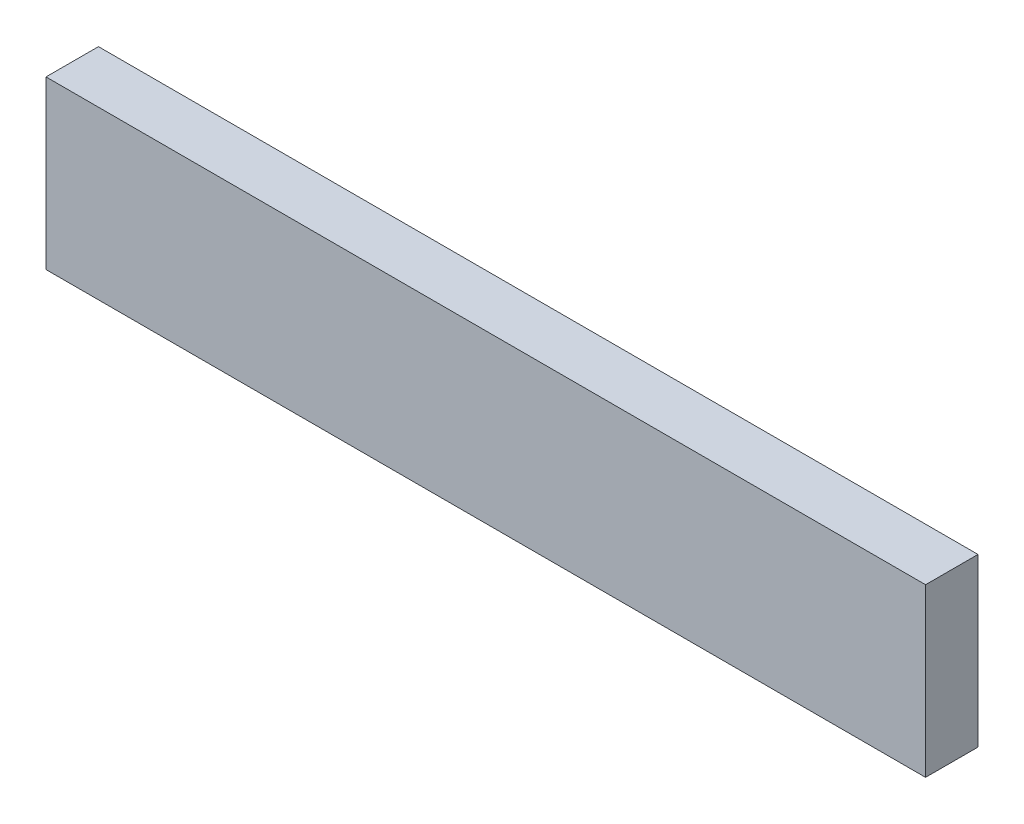
ISO-10303-21;
HEADER;
FILE_DESCRIPTION(('STEP AP214'),'2;1');
FILE_NAME('part.step','',(''),(''),'','','');
FILE_SCHEMA(('AUTOMOTIVE_DESIGN { 1 0 10303 214 1 1 1 1 }'));
ENDSEC;
DATA;
#1=APPLICATION_CONTEXT('core data for automotive mechanical design processes');
#2=APPLICATION_PROTOCOL_DEFINITION('international standard','automotive_design',2000,#1);
#3=PRODUCT_CONTEXT('',#1,'mechanical');
#4=PRODUCT('Part','Part','',(#3));
#5=PRODUCT_RELATED_PRODUCT_CATEGORY('part','',(#4));
#6=PRODUCT_DEFINITION_FORMATION('','',#4);
#7=PRODUCT_DEFINITION_CONTEXT('part definition',#1,'design');
#8=PRODUCT_DEFINITION('design','',#6,#7);
#9=PRODUCT_DEFINITION_SHAPE('','',#8);
#10=(LENGTH_UNIT() NAMED_UNIT(*) SI_UNIT(.MILLI.,.METRE.));
#11=(NAMED_UNIT(*) PLANE_ANGLE_UNIT() SI_UNIT($,.RADIAN.));
#12=(NAMED_UNIT(*) SI_UNIT($,.STERADIAN.) SOLID_ANGLE_UNIT());
#13=UNCERTAINTY_MEASURE_WITH_UNIT(LENGTH_MEASURE(1.E-05),#10,'distance_accuracy_value','');
#14=(GEOMETRIC_REPRESENTATION_CONTEXT(3) GLOBAL_UNCERTAINTY_ASSIGNED_CONTEXT((#13)) GLOBAL_UNIT_ASSIGNED_CONTEXT((#10,
#11,#12)) REPRESENTATION_CONTEXT('',''));
#15=CARTESIAN_POINT('',(0.,0.,0.));
#16=DIRECTION('',(0.,0.,1.));
#17=DIRECTION('',(1.,0.,0.));
#18=AXIS2_PLACEMENT_3D('',#15,#16,#17);
#19=CARTESIAN_POINT('',(184.5,35.,22.));
#20=DIRECTION('',(-1.,0.,0.));
#21=DIRECTION('',(0.,0.,1.));
#22=AXIS2_PLACEMENT_3D('',#19,#20,#21);
#23=PLANE('',#22);
#24=DIRECTION('',(0.,1.,0.));
#25=VECTOR('',#24,1.);
#26=CARTESIAN_POINT('',(184.5,35.,0.));
#27=LINE('',#26,#25);
#28=CARTESIAN_POINT('',(184.5,-35.,0.));
#29=VERTEX_POINT('',#28);
#30=CARTESIAN_POINT('',(184.5,35.,0.));
#31=VERTEX_POINT('',#30);
#32=EDGE_CURVE('E96',#29,#31,#27,.T.);
#33=ORIENTED_EDGE('',*,*,#32,.T.);
#34=DIRECTION('',(0.,0.,-1.));
#35=VECTOR('',#34,1.);
#36=CARTESIAN_POINT('',(184.5,35.,22.));
#37=LINE('',#36,#35);
#38=CARTESIAN_POINT('',(184.5,35.,22.));
#39=VERTEX_POINT('',#38);
#40=EDGE_CURVE('E11',#39,#31,#37,.T.);
#41=ORIENTED_EDGE('',*,*,#40,.F.);
#42=DIRECTION('',(0.,1.,0.));
#43=VECTOR('',#42,1.);
#44=CARTESIAN_POINT('',(184.5,35.,22.));
#45=LINE('',#44,#43);
#46=CARTESIAN_POINT('',(184.5,-35.,22.));
#47=VERTEX_POINT('',#46);
#48=EDGE_CURVE('E84',#47,#39,#45,.T.);
#49=ORIENTED_EDGE('',*,*,#48,.F.);
#50=DIRECTION('',(0.,0.,-1.));
#51=VECTOR('',#50,1.);
#52=CARTESIAN_POINT('',(184.5,-35.,22.));
#53=LINE('',#52,#51);
#54=EDGE_CURVE('E92',#47,#29,#53,.T.);
#55=ORIENTED_EDGE('',*,*,#54,.T.);
#56=EDGE_LOOP('',(#33,#41,#49,#55));
#57=FACE_BOUND('',#56,.T.);
#58=ADVANCED_FACE('F33',(#57),#23,.F.);
#59=CARTESIAN_POINT('',(-184.5,35.,22.));
#60=DIRECTION('',(0.,-1.,0.));
#61=DIRECTION('',(0.,0.,-1.));
#62=AXIS2_PLACEMENT_3D('',#59,#60,#61);
#63=PLANE('',#62);
#64=DIRECTION('',(-1.,0.,0.));
#65=VECTOR('',#64,1.);
#66=CARTESIAN_POINT('',(-184.5,35.,0.));
#67=LINE('',#66,#65);
#68=CARTESIAN_POINT('',(-184.5,35.,0.));
#69=VERTEX_POINT('',#68);
#70=EDGE_CURVE('E88',#31,#69,#67,.T.);
#71=ORIENTED_EDGE('',*,*,#70,.T.);
#72=DIRECTION('',(0.,0.,-1.));
#73=VECTOR('',#72,1.);
#74=CARTESIAN_POINT('',(-184.5,35.,22.));
#75=LINE('',#74,#73);
#76=CARTESIAN_POINT('',(-184.5,35.,22.));
#77=VERTEX_POINT('',#76);
#78=EDGE_CURVE('E41',#77,#69,#75,.T.);
#79=ORIENTED_EDGE('',*,*,#78,.F.);
#80=DIRECTION('',(-1.,0.,0.));
#81=VECTOR('',#80,1.);
#82=CARTESIAN_POINT('',(-184.5,35.,22.));
#83=LINE('',#82,#81);
#84=EDGE_CURVE('E79',#39,#77,#83,.T.);
#85=ORIENTED_EDGE('',*,*,#84,.F.);
#86=ORIENTED_EDGE('',*,*,#40,.T.);
#87=EDGE_LOOP('',(#71,#79,#85,#86));
#88=FACE_BOUND('',#87,.T.);
#89=ADVANCED_FACE('F87',(#88),#63,.F.);
#90=CARTESIAN_POINT('',(-184.5,35.,22.));
#91=DIRECTION('',(1.,0.,0.));
#92=DIRECTION('',(0.,0.,-1.));
#93=AXIS2_PLACEMENT_3D('',#90,#91,#92);
#94=PLANE('',#93);
#95=DIRECTION('',(0.,-1.,0.));
#96=VECTOR('',#95,1.);
#97=CARTESIAN_POINT('',(-184.5,35.,0.));
#98=LINE('',#97,#96);
#99=CARTESIAN_POINT('',(-184.5,-35.,0.));
#100=VERTEX_POINT('',#99);
#101=EDGE_CURVE('E66',#69,#100,#98,.T.);
#102=ORIENTED_EDGE('',*,*,#101,.T.);
#103=DIRECTION('',(0.,0.,-1.));
#104=VECTOR('',#103,1.);
#105=CARTESIAN_POINT('',(-184.5,-35.,22.));
#106=LINE('',#105,#104);
#107=CARTESIAN_POINT('',(-184.5,-35.,22.));
#108=VERTEX_POINT('',#107);
#109=EDGE_CURVE('E89',#108,#100,#106,.T.);
#110=ORIENTED_EDGE('',*,*,#109,.F.);
#111=DIRECTION('',(0.,-1.,0.));
#112=VECTOR('',#111,1.);
#113=CARTESIAN_POINT('',(-184.5,35.,22.));
#114=LINE('',#113,#112);
#115=EDGE_CURVE('E82',#77,#108,#114,.T.);
#116=ORIENTED_EDGE('',*,*,#115,.F.);
#117=ORIENTED_EDGE('',*,*,#78,.T.);
#118=EDGE_LOOP('',(#102,#110,#116,#117));
#119=FACE_BOUND('',#118,.T.);
#120=ADVANCED_FACE('F90',(#119),#94,.F.);
#121=CARTESIAN_POINT('',(-184.5,-35.,22.));
#122=DIRECTION('',(0.,1.,0.));
#123=DIRECTION('',(0.,0.,1.));
#124=AXIS2_PLACEMENT_3D('',#121,#122,#123);
#125=PLANE('',#124);
#126=DIRECTION('',(1.,0.,0.));
#127=VECTOR('',#126,1.);
#128=CARTESIAN_POINT('',(-184.5,-35.,0.));
#129=LINE('',#128,#127);
#130=EDGE_CURVE('E72',#100,#29,#129,.T.);
#131=ORIENTED_EDGE('',*,*,#130,.T.);
#132=ORIENTED_EDGE('',*,*,#54,.F.);
#133=DIRECTION('',(1.,0.,0.));
#134=VECTOR('',#133,1.);
#135=CARTESIAN_POINT('',(-184.5,-35.,22.));
#136=LINE('',#135,#134);
#137=EDGE_CURVE('E49',#108,#47,#136,.T.);
#138=ORIENTED_EDGE('',*,*,#137,.F.);
#139=ORIENTED_EDGE('',*,*,#109,.T.);
#140=EDGE_LOOP('',(#131,#132,#138,#139));
#141=FACE_BOUND('',#140,.T.);
#142=ADVANCED_FACE('F103',(#141),#125,.F.);
#143=CARTESIAN_POINT('',(0.,0.,22.));
#144=DIRECTION('',(0.,0.,1.));
#145=DIRECTION('',(1.,0.,0.));
#146=AXIS2_PLACEMENT_3D('',#143,#144,#145);
#147=PLANE('',#146);
#148=ORIENTED_EDGE('',*,*,#48,.T.);
#149=ORIENTED_EDGE('',*,*,#84,.T.);
#150=ORIENTED_EDGE('',*,*,#115,.T.);
#151=ORIENTED_EDGE('',*,*,#137,.T.);
#152=EDGE_LOOP('',(#148,#149,#150,#151));
#153=FACE_BOUND('',#152,.T.);
#154=ADVANCED_FACE('F80',(#153),#147,.T.);
#155=CARTESIAN_POINT('',(0.,0.,0.));
#156=DIRECTION('',(0.,0.,1.));
#157=DIRECTION('',(1.,0.,0.));
#158=AXIS2_PLACEMENT_3D('',#155,#156,#157);
#159=PLANE('',#158);
#160=ORIENTED_EDGE('',*,*,#32,.F.);
#161=ORIENTED_EDGE('',*,*,#130,.F.);
#162=ORIENTED_EDGE('',*,*,#101,.F.);
#163=ORIENTED_EDGE('',*,*,#70,.F.);
#164=EDGE_LOOP('',(#160,#161,#162,#163));
#165=FACE_BOUND('',#164,.T.);
#166=ADVANCED_FACE('F106',(#165),#159,.F.);
#167=CLOSED_SHELL('',(#58,#89,#120,#142,#154,#166));
#168=MANIFOLD_SOLID_BREP('B2',#167);
#169=ADVANCED_BREP_SHAPE_REPRESENTATION('',(#18,#168),#14);
#170=SHAPE_DEFINITION_REPRESENTATION(#9,#169);
ENDSEC;
END-ISO-10303-21;
